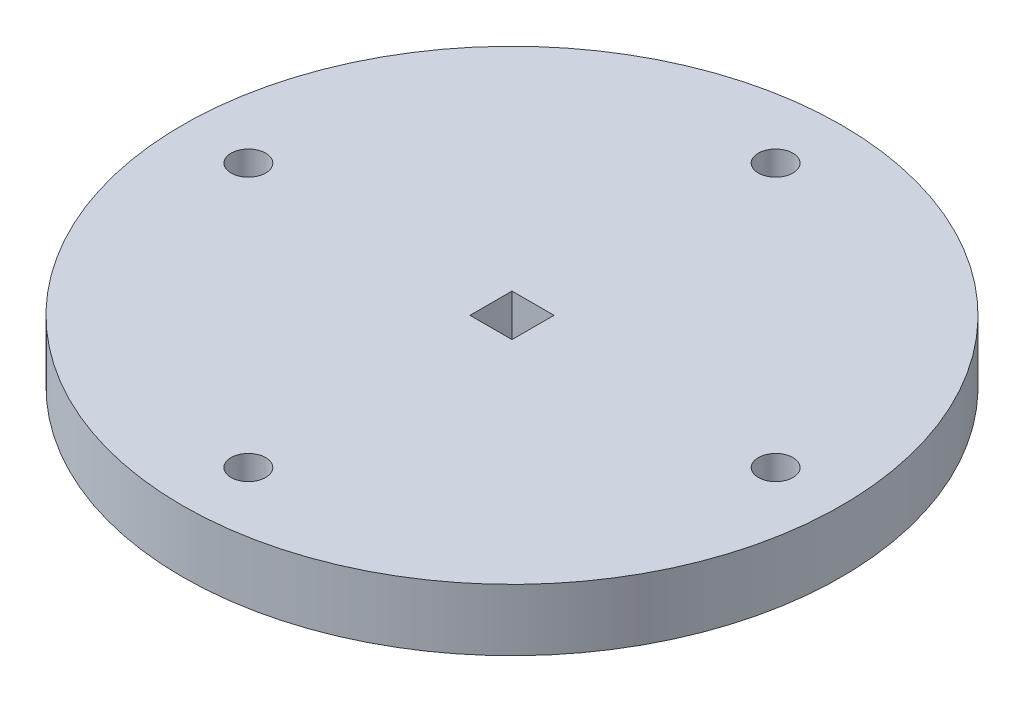
ISO-10303-21;
HEADER;
FILE_DESCRIPTION(('STEP AP214'),'2;1');
FILE_NAME('part.step','',(''),(''),'','','');
FILE_SCHEMA(('AUTOMOTIVE_DESIGN { 1 0 10303 214 1 1 1 1 }'));
ENDSEC;
DATA;
#1=APPLICATION_CONTEXT('core data for automotive mechanical design processes');
#2=APPLICATION_PROTOCOL_DEFINITION('international standard','automotive_design',2000,#1);
#3=PRODUCT_CONTEXT('',#1,'mechanical');
#4=PRODUCT('Part','Part','',(#3));
#5=PRODUCT_RELATED_PRODUCT_CATEGORY('part','',(#4));
#6=PRODUCT_DEFINITION_FORMATION('','',#4);
#7=PRODUCT_DEFINITION_CONTEXT('part definition',#1,'design');
#8=PRODUCT_DEFINITION('design','',#6,#7);
#9=PRODUCT_DEFINITION_SHAPE('','',#8);
#10=(LENGTH_UNIT() NAMED_UNIT(*) SI_UNIT(.MILLI.,.METRE.));
#11=(NAMED_UNIT(*) PLANE_ANGLE_UNIT() SI_UNIT($,.RADIAN.));
#12=(NAMED_UNIT(*) SI_UNIT($,.STERADIAN.) SOLID_ANGLE_UNIT());
#13=UNCERTAINTY_MEASURE_WITH_UNIT(LENGTH_MEASURE(1.E-05),#10,'distance_accuracy_value','');
#14=(GEOMETRIC_REPRESENTATION_CONTEXT(3) GLOBAL_UNCERTAINTY_ASSIGNED_CONTEXT((#13)) GLOBAL_UNIT_ASSIGNED_CONTEXT((#10,
#11,#12)) REPRESENTATION_CONTEXT('',''));
#15=CARTESIAN_POINT('',(0.,0.,0.));
#16=DIRECTION('',(0.,0.,1.));
#17=DIRECTION('',(1.,0.,0.));
#18=AXIS2_PLACEMENT_3D('',#15,#16,#17);
#19=CARTESIAN_POINT('',(0.,9.525,0.));
#20=DIRECTION('',(0.,-1.,0.));
#21=DIRECTION('',(0.,0.,-1.));
#22=AXIS2_PLACEMENT_3D('',#19,#20,#21);
#23=CYLINDRICAL_SURFACE('',#22,50.8);
#24=CARTESIAN_POINT('',(0.,9.525,0.));
#25=DIRECTION('',(0.,1.,0.));
#26=DIRECTION('',(0.,0.,1.));
#27=AXIS2_PLACEMENT_3D('',#24,#25,#26);
#28=CIRCLE('',#27,50.8);
#29=CARTESIAN_POINT('',(0.,9.525,50.8));
#30=VERTEX_POINT('',#29);
#31=EDGE_CURVE('E11',#30,#30,#28,.T.);
#32=ORIENTED_EDGE('',*,*,#31,.F.);
#33=EDGE_LOOP('',(#32));
#34=FACE_BOUND('',#33,.T.);
#35=CARTESIAN_POINT('',(0.,0.,0.));
#36=DIRECTION('',(0.,1.,0.));
#37=DIRECTION('',(0.,0.,1.));
#38=AXIS2_PLACEMENT_3D('',#35,#36,#37);
#39=CIRCLE('',#38,50.8);
#40=CARTESIAN_POINT('',(0.,0.,50.8));
#41=VERTEX_POINT('',#40);
#42=EDGE_CURVE('E39',#41,#41,#39,.T.);
#43=ORIENTED_EDGE('',*,*,#42,.T.);
#44=EDGE_LOOP('',(#43));
#45=FACE_BOUND('',#44,.T.);
#46=ADVANCED_FACE('F36',(#34,#45),#23,.T.);
#47=CARTESIAN_POINT('',(0.,9.525,0.));
#48=DIRECTION('',(0.,1.,0.));
#49=DIRECTION('',(0.,0.,1.));
#50=AXIS2_PLACEMENT_3D('',#47,#48,#49);
#51=PLANE('',#50);
#52=DIRECTION('',(0.,0.,1.));
#53=VECTOR('',#52,1.);
#54=CARTESIAN_POINT('',(-3.2385,9.525,-3.2385));
#55=LINE('',#54,#53);
#56=CARTESIAN_POINT('',(-3.2385,9.525,-3.2385));
#57=VERTEX_POINT('',#56);
#58=CARTESIAN_POINT('',(-3.2385,9.525,3.2385));
#59=VERTEX_POINT('',#58);
#60=EDGE_CURVE('E50',#57,#59,#55,.T.);
#61=ORIENTED_EDGE('',*,*,#60,.F.);
#62=DIRECTION('',(-1.,0.,0.));
#63=VECTOR('',#62,1.);
#64=CARTESIAN_POINT('',(3.2385,9.525,-3.2385));
#65=LINE('',#64,#63);
#66=CARTESIAN_POINT('',(3.2385,9.525,-3.2385));
#67=VERTEX_POINT('',#66);
#68=EDGE_CURVE('E94',#67,#57,#65,.T.);
#69=ORIENTED_EDGE('',*,*,#68,.F.);
#70=DIRECTION('',(0.,0.,-1.));
#71=VECTOR('',#70,1.);
#72=CARTESIAN_POINT('',(3.2385,9.525,-3.2385));
#73=LINE('',#72,#71);
#74=CARTESIAN_POINT('',(3.2385,9.525,3.2385));
#75=VERTEX_POINT('',#74);
#76=EDGE_CURVE('E97',#75,#67,#73,.T.);
#77=ORIENTED_EDGE('',*,*,#76,.F.);
#78=DIRECTION('',(1.,0.,0.));
#79=VECTOR('',#78,1.);
#80=CARTESIAN_POINT('',(3.2385,9.525,3.2385));
#81=LINE('',#80,#79);
#82=EDGE_CURVE('E103',#59,#75,#81,.T.);
#83=ORIENTED_EDGE('',*,*,#82,.F.);
#84=EDGE_LOOP('',(#61,#69,#77,#83));
#85=FACE_BOUND('',#84,.T.);
#86=CARTESIAN_POINT('',(0.,9.525,40.64));
#87=DIRECTION('',(0.,1.,0.));
#88=DIRECTION('',(0.,0.,1.));
#89=AXIS2_PLACEMENT_3D('',#86,#87,#88);
#90=CIRCLE('',#89,2.667);
#91=CARTESIAN_POINT('',(0.,9.525,43.307));
#92=VERTEX_POINT('',#91);
#93=EDGE_CURVE('E116',#92,#92,#90,.T.);
#94=ORIENTED_EDGE('',*,*,#93,.F.);
#95=EDGE_LOOP('',(#94));
#96=FACE_BOUND('',#95,.T.);
#97=CARTESIAN_POINT('',(-40.64,9.525,0.));
#98=DIRECTION('',(0.,1.,0.));
#99=DIRECTION('',(0.,0.,1.));
#100=AXIS2_PLACEMENT_3D('',#97,#98,#99);
#101=CIRCLE('',#100,2.66699999999986);
#102=CARTESIAN_POINT('',(-40.64,9.525,2.66699999999986));
#103=VERTEX_POINT('',#102);
#104=EDGE_CURVE('E122',#103,#103,#101,.T.);
#105=ORIENTED_EDGE('',*,*,#104,.F.);
#106=EDGE_LOOP('',(#105));
#107=FACE_BOUND('',#106,.T.);
#108=CARTESIAN_POINT('',(2.8378760322117E-13,9.525,-40.64));
#109=DIRECTION('',(0.,1.,0.));
#110=DIRECTION('',(0.,0.,1.));
#111=AXIS2_PLACEMENT_3D('',#108,#109,#110);
#112=CIRCLE('',#111,2.667);
#113=CARTESIAN_POINT('',(2.8378760322117E-13,9.525,-37.973));
#114=VERTEX_POINT('',#113);
#115=EDGE_CURVE('E128',#114,#114,#112,.T.);
#116=ORIENTED_EDGE('',*,*,#115,.F.);
#117=EDGE_LOOP('',(#116));
#118=FACE_BOUND('',#117,.T.);
#119=CARTESIAN_POINT('',(40.64,9.525,4.25681404831755E-13));
#120=DIRECTION('',(0.,1.,0.));
#121=DIRECTION('',(0.,0.,1.));
#122=AXIS2_PLACEMENT_3D('',#119,#120,#121);
#123=CIRCLE('',#122,2.667);
#124=CARTESIAN_POINT('',(40.64,9.525,2.66700000000043));
#125=VERTEX_POINT('',#124);
#126=EDGE_CURVE('E109',#125,#125,#123,.T.);
#127=ORIENTED_EDGE('',*,*,#126,.F.);
#128=EDGE_LOOP('',(#127));
#129=FACE_BOUND('',#128,.T.);
#130=ORIENTED_EDGE('',*,*,#31,.T.);
#131=EDGE_LOOP('',(#130));
#132=FACE_BOUND('',#131,.T.);
#133=ADVANCED_FACE('F139',(#85,#96,#107,#118,#129,#132),#51,.T.);
#134=CARTESIAN_POINT('',(0.,0.,0.));
#135=DIRECTION('',(0.,1.,0.));
#136=DIRECTION('',(0.,0.,1.));
#137=AXIS2_PLACEMENT_3D('',#134,#135,#136);
#138=PLANE('',#137);
#139=DIRECTION('',(-1.,0.,0.));
#140=VECTOR('',#139,1.);
#141=CARTESIAN_POINT('',(3.2385,0.,-3.2385));
#142=LINE('',#141,#140);
#143=CARTESIAN_POINT('',(3.2385,0.,-3.2385));
#144=VERTEX_POINT('',#143);
#145=CARTESIAN_POINT('',(-3.2385,0.,-3.2385));
#146=VERTEX_POINT('',#145);
#147=EDGE_CURVE('E84',#144,#146,#142,.T.);
#148=ORIENTED_EDGE('',*,*,#147,.T.);
#149=DIRECTION('',(0.,0.,1.));
#150=VECTOR('',#149,1.);
#151=CARTESIAN_POINT('',(-3.2385,0.,-3.2385));
#152=LINE('',#151,#150);
#153=CARTESIAN_POINT('',(-3.2385,0.,3.2385));
#154=VERTEX_POINT('',#153);
#155=EDGE_CURVE('E78',#146,#154,#152,.T.);
#156=ORIENTED_EDGE('',*,*,#155,.T.);
#157=DIRECTION('',(1.,0.,0.));
#158=VECTOR('',#157,1.);
#159=CARTESIAN_POINT('',(3.2385,0.,3.2385));
#160=LINE('',#159,#158);
#161=CARTESIAN_POINT('',(3.2385,0.,3.2385));
#162=VERTEX_POINT('',#161);
#163=EDGE_CURVE('E87',#154,#162,#160,.T.);
#164=ORIENTED_EDGE('',*,*,#163,.T.);
#165=DIRECTION('',(0.,0.,-1.));
#166=VECTOR('',#165,1.);
#167=CARTESIAN_POINT('',(3.2385,0.,-3.2385));
#168=LINE('',#167,#166);
#169=EDGE_CURVE('E58',#162,#144,#168,.T.);
#170=ORIENTED_EDGE('',*,*,#169,.T.);
#171=EDGE_LOOP('',(#148,#156,#164,#170));
#172=FACE_BOUND('',#171,.T.);
#173=CARTESIAN_POINT('',(0.,0.,40.64));
#174=DIRECTION('',(0.,1.,0.));
#175=DIRECTION('',(0.,0.,1.));
#176=AXIS2_PLACEMENT_3D('',#173,#174,#175);
#177=CIRCLE('',#176,2.667);
#178=CARTESIAN_POINT('',(0.,0.,43.307));
#179=VERTEX_POINT('',#178);
#180=EDGE_CURVE('E113',#179,#179,#177,.T.);
#181=ORIENTED_EDGE('',*,*,#180,.T.);
#182=EDGE_LOOP('',(#181));
#183=FACE_BOUND('',#182,.T.);
#184=CARTESIAN_POINT('',(-40.64,0.,0.));
#185=DIRECTION('',(0.,1.,0.));
#186=DIRECTION('',(0.,0.,1.));
#187=AXIS2_PLACEMENT_3D('',#184,#185,#186);
#188=CIRCLE('',#187,2.66699999999986);
#189=CARTESIAN_POINT('',(-40.64,0.,2.66699999999986));
#190=VERTEX_POINT('',#189);
#191=EDGE_CURVE('E119',#190,#190,#188,.T.);
#192=ORIENTED_EDGE('',*,*,#191,.T.);
#193=EDGE_LOOP('',(#192));
#194=FACE_BOUND('',#193,.T.);
#195=CARTESIAN_POINT('',(2.8378760322117E-13,0.,-40.64));
#196=DIRECTION('',(0.,1.,0.));
#197=DIRECTION('',(0.,0.,1.));
#198=AXIS2_PLACEMENT_3D('',#195,#196,#197);
#199=CIRCLE('',#198,2.667);
#200=CARTESIAN_POINT('',(2.8378760322117E-13,0.,-37.973));
#201=VERTEX_POINT('',#200);
#202=EDGE_CURVE('E125',#201,#201,#199,.T.);
#203=ORIENTED_EDGE('',*,*,#202,.T.);
#204=EDGE_LOOP('',(#203));
#205=FACE_BOUND('',#204,.T.);
#206=CARTESIAN_POINT('',(40.64,0.,4.25681404831755E-13));
#207=DIRECTION('',(0.,1.,0.));
#208=DIRECTION('',(0.,0.,1.));
#209=AXIS2_PLACEMENT_3D('',#206,#207,#208);
#210=CIRCLE('',#209,2.667);
#211=CARTESIAN_POINT('',(40.64,0.,2.66700000000043));
#212=VERTEX_POINT('',#211);
#213=EDGE_CURVE('E131',#212,#212,#210,.T.);
#214=ORIENTED_EDGE('',*,*,#213,.T.);
#215=EDGE_LOOP('',(#214));
#216=FACE_BOUND('',#215,.T.);
#217=ORIENTED_EDGE('',*,*,#42,.F.);
#218=EDGE_LOOP('',(#217));
#219=FACE_BOUND('',#218,.T.);
#220=ADVANCED_FACE('F91',(#172,#183,#194,#205,#216,#219),#138,.F.);
#221=CARTESIAN_POINT('',(40.64,0.,4.25681404831755E-13));
#222=DIRECTION('',(0.,1.,0.));
#223=DIRECTION('',(0.,0.,1.));
#224=AXIS2_PLACEMENT_3D('',#221,#222,#223);
#225=CYLINDRICAL_SURFACE('',#224,2.667);
#226=ORIENTED_EDGE('',*,*,#213,.F.);
#227=EDGE_LOOP('',(#226));
#228=FACE_BOUND('',#227,.T.);
#229=ORIENTED_EDGE('',*,*,#126,.T.);
#230=EDGE_LOOP('',(#229));
#231=FACE_BOUND('',#230,.T.);
#232=ADVANCED_FACE('F137',(#228,#231),#225,.F.);
#233=CARTESIAN_POINT('',(2.8378760322117E-13,0.,-40.64));
#234=DIRECTION('',(0.,1.,0.));
#235=DIRECTION('',(0.,0.,1.));
#236=AXIS2_PLACEMENT_3D('',#233,#234,#235);
#237=CYLINDRICAL_SURFACE('',#236,2.667);
#238=ORIENTED_EDGE('',*,*,#202,.F.);
#239=EDGE_LOOP('',(#238));
#240=FACE_BOUND('',#239,.T.);
#241=ORIENTED_EDGE('',*,*,#115,.T.);
#242=EDGE_LOOP('',(#241));
#243=FACE_BOUND('',#242,.T.);
#244=ADVANCED_FACE('F155',(#240,#243),#237,.F.);
#245=CARTESIAN_POINT('',(-40.64,0.,0.));
#246=DIRECTION('',(0.,1.,0.));
#247=DIRECTION('',(0.,0.,1.));
#248=AXIS2_PLACEMENT_3D('',#245,#246,#247);
#249=CYLINDRICAL_SURFACE('',#248,2.66699999999986);
#250=ORIENTED_EDGE('',*,*,#191,.F.);
#251=EDGE_LOOP('',(#250));
#252=FACE_BOUND('',#251,.T.);
#253=ORIENTED_EDGE('',*,*,#104,.T.);
#254=EDGE_LOOP('',(#253));
#255=FACE_BOUND('',#254,.T.);
#256=ADVANCED_FACE('F161',(#252,#255),#249,.F.);
#257=CARTESIAN_POINT('',(0.,0.,40.64));
#258=DIRECTION('',(0.,1.,0.));
#259=DIRECTION('',(0.,0.,1.));
#260=AXIS2_PLACEMENT_3D('',#257,#258,#259);
#261=CYLINDRICAL_SURFACE('',#260,2.667);
#262=ORIENTED_EDGE('',*,*,#180,.F.);
#263=EDGE_LOOP('',(#262));
#264=FACE_BOUND('',#263,.T.);
#265=ORIENTED_EDGE('',*,*,#93,.T.);
#266=EDGE_LOOP('',(#265));
#267=FACE_BOUND('',#266,.T.);
#268=ADVANCED_FACE('F165',(#264,#267),#261,.F.);
#269=CARTESIAN_POINT('',(-3.2385,0.,-3.2385));
#270=DIRECTION('',(-1.,0.,0.));
#271=DIRECTION('',(0.,0.,1.));
#272=AXIS2_PLACEMENT_3D('',#269,#270,#271);
#273=PLANE('',#272);
#274=ORIENTED_EDGE('',*,*,#60,.T.);
#275=DIRECTION('',(0.,1.,0.));
#276=VECTOR('',#275,1.);
#277=CARTESIAN_POINT('',(-3.2385,0.,3.2385));
#278=LINE('',#277,#276);
#279=EDGE_CURVE('E74',#154,#59,#278,.T.);
#280=ORIENTED_EDGE('',*,*,#279,.F.);
#281=ORIENTED_EDGE('',*,*,#155,.F.);
#282=DIRECTION('',(0.,1.,0.));
#283=VECTOR('',#282,1.);
#284=CARTESIAN_POINT('',(-3.2385,0.,-3.2385));
#285=LINE('',#284,#283);
#286=EDGE_CURVE('E107',#146,#57,#285,.T.);
#287=ORIENTED_EDGE('',*,*,#286,.T.);
#288=EDGE_LOOP('',(#274,#280,#281,#287));
#289=FACE_BOUND('',#288,.T.);
#290=ADVANCED_FACE('F76',(#289),#273,.F.);
#291=CARTESIAN_POINT('',(3.2385,0.,-3.2385));
#292=DIRECTION('',(0.,0.,-1.));
#293=DIRECTION('',(-1.,0.,0.));
#294=AXIS2_PLACEMENT_3D('',#291,#292,#293);
#295=PLANE('',#294);
#296=ORIENTED_EDGE('',*,*,#68,.T.);
#297=ORIENTED_EDGE('',*,*,#286,.F.);
#298=ORIENTED_EDGE('',*,*,#147,.F.);
#299=DIRECTION('',(0.,1.,0.));
#300=VECTOR('',#299,1.);
#301=CARTESIAN_POINT('',(3.2385,0.,-3.2385));
#302=LINE('',#301,#300);
#303=EDGE_CURVE('E110',#144,#67,#302,.T.);
#304=ORIENTED_EDGE('',*,*,#303,.T.);
#305=EDGE_LOOP('',(#296,#297,#298,#304));
#306=FACE_BOUND('',#305,.T.);
#307=ADVANCED_FACE('F172',(#306),#295,.F.);
#308=CARTESIAN_POINT('',(3.2385,0.,-3.2385));
#309=DIRECTION('',(1.,0.,0.));
#310=DIRECTION('',(0.,0.,-1.));
#311=AXIS2_PLACEMENT_3D('',#308,#309,#310);
#312=PLANE('',#311);
#313=ORIENTED_EDGE('',*,*,#76,.T.);
#314=ORIENTED_EDGE('',*,*,#303,.F.);
#315=ORIENTED_EDGE('',*,*,#169,.F.);
#316=DIRECTION('',(0.,1.,0.));
#317=VECTOR('',#316,1.);
#318=CARTESIAN_POINT('',(3.2385,0.,3.2385));
#319=LINE('',#318,#317);
#320=EDGE_CURVE('E83',#162,#75,#319,.T.);
#321=ORIENTED_EDGE('',*,*,#320,.T.);
#322=EDGE_LOOP('',(#313,#314,#315,#321));
#323=FACE_BOUND('',#322,.T.);
#324=ADVANCED_FACE('F175',(#323),#312,.F.);
#325=CARTESIAN_POINT('',(3.2385,0.,3.2385));
#326=DIRECTION('',(0.,0.,1.));
#327=DIRECTION('',(1.,0.,0.));
#328=AXIS2_PLACEMENT_3D('',#325,#326,#327);
#329=PLANE('',#328);
#330=ORIENTED_EDGE('',*,*,#82,.T.);
#331=ORIENTED_EDGE('',*,*,#320,.F.);
#332=ORIENTED_EDGE('',*,*,#163,.F.);
#333=ORIENTED_EDGE('',*,*,#279,.T.);
#334=EDGE_LOOP('',(#330,#331,#332,#333));
#335=FACE_BOUND('',#334,.T.);
#336=ADVANCED_FACE('F88',(#335),#329,.F.);
#337=CLOSED_SHELL('',(#46,#133,#220,#232,#244,#256,#268,#290,#307,#324,#336));
#338=MANIFOLD_SOLID_BREP('B2',#337);
#339=ADVANCED_BREP_SHAPE_REPRESENTATION('',(#18,#338),#14);
#340=SHAPE_DEFINITION_REPRESENTATION(#9,#339);
ENDSEC;
END-ISO-10303-21;
